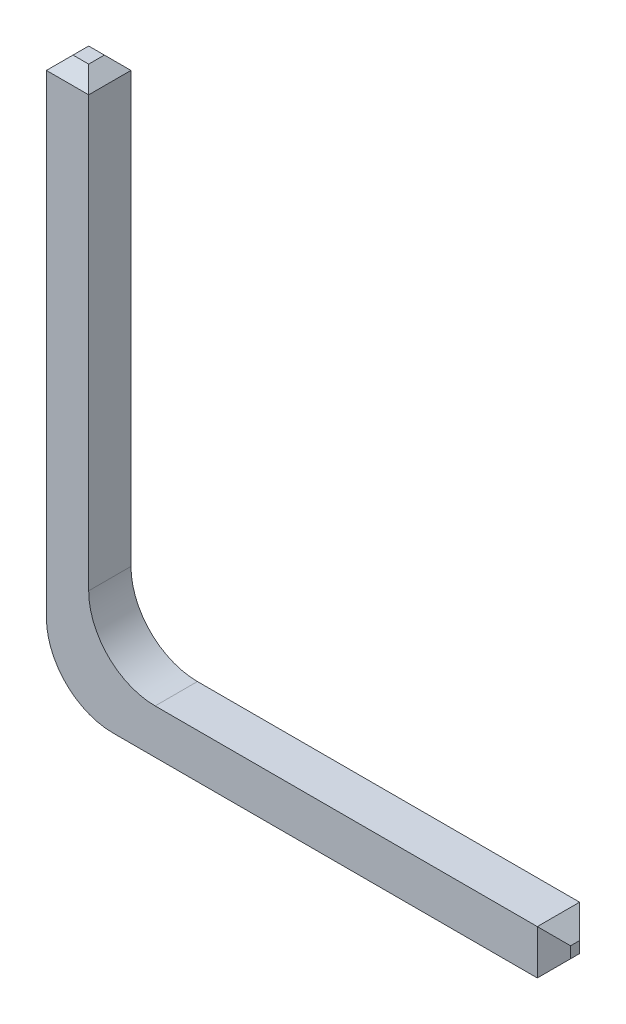
ISO-10303-21;
HEADER;
FILE_DESCRIPTION(('STEP AP214'),'2;1');
FILE_NAME('part.step','',(''),(''),'','','');
FILE_SCHEMA(('AUTOMOTIVE_DESIGN { 1 0 10303 214 1 1 1 1 }'));
ENDSEC;
DATA;
#1=APPLICATION_CONTEXT('core data for automotive mechanical design processes');
#2=APPLICATION_PROTOCOL_DEFINITION('international standard','automotive_design',2000,#1);
#3=PRODUCT_CONTEXT('',#1,'mechanical');
#4=PRODUCT('Part','Part','',(#3));
#5=PRODUCT_RELATED_PRODUCT_CATEGORY('part','',(#4));
#6=PRODUCT_DEFINITION_FORMATION('','',#4);
#7=PRODUCT_DEFINITION_CONTEXT('part definition',#1,'design');
#8=PRODUCT_DEFINITION('design','',#6,#7);
#9=PRODUCT_DEFINITION_SHAPE('','',#8);
#10=(LENGTH_UNIT() NAMED_UNIT(*) SI_UNIT(.MILLI.,.METRE.));
#11=(NAMED_UNIT(*) PLANE_ANGLE_UNIT() SI_UNIT($,.RADIAN.));
#12=(NAMED_UNIT(*) SI_UNIT($,.STERADIAN.) SOLID_ANGLE_UNIT());
#13=UNCERTAINTY_MEASURE_WITH_UNIT(LENGTH_MEASURE(1.E-05),#10,'distance_accuracy_value','');
#14=(GEOMETRIC_REPRESENTATION_CONTEXT(3) GLOBAL_UNCERTAINTY_ASSIGNED_CONTEXT((#13)) GLOBAL_UNIT_ASSIGNED_CONTEXT((#10,
#11,#12)) REPRESENTATION_CONTEXT('',''));
#15=CARTESIAN_POINT('',(0.,0.,0.));
#16=DIRECTION('',(0.,0.,1.));
#17=DIRECTION('',(1.,0.,0.));
#18=AXIS2_PLACEMENT_3D('',#15,#16,#17);
#19=CARTESIAN_POINT('',(0.,11.54,0.));
#20=DIRECTION('',(1.,0.,0.));
#21=DIRECTION('',(0.,0.,-1.));
#22=AXIS2_PLACEMENT_3D('',#19,#20,#21);
#23=PLANE('',#22);
#24=DIRECTION('',(0.,-1.,0.));
#25=VECTOR('',#24,1.);
#26=CARTESIAN_POINT('',(0.,11.54,0.));
#27=LINE('',#26,#25);
#28=CARTESIAN_POINT('',(0.,11.34,0.));
#29=VERTEX_POINT('',#28);
#30=CARTESIAN_POINT('',(0.,4.20708962701083,0.));
#31=VERTEX_POINT('',#30);
#32=EDGE_CURVE('E143',#29,#31,#27,.T.);
#33=ORIENTED_EDGE('',*,*,#32,.T.);
#34=DIRECTION('',(0.,0.,-1.));
#35=VECTOR('',#34,1.);
#36=CARTESIAN_POINT('',(0.,4.20708962701083,0.636));
#37=LINE('',#36,#35);
#38=CARTESIAN_POINT('',(0.,4.20708962701083,0.636));
#39=VERTEX_POINT('',#38);
#40=EDGE_CURVE('E49',#31,#39,#37,.F.);
#41=ORIENTED_EDGE('',*,*,#40,.T.);
#42=DIRECTION('',(0.,-1.,0.));
#43=VECTOR('',#42,1.);
#44=CARTESIAN_POINT('',(0.,11.54,0.636));
#45=LINE('',#44,#43);
#46=CARTESIAN_POINT('',(0.,11.34,0.636));
#47=VERTEX_POINT('',#46);
#48=EDGE_CURVE('E149',#47,#39,#45,.T.);
#49=ORIENTED_EDGE('',*,*,#48,.F.);
#50=DIRECTION('',(0.,0.,-1.));
#51=VECTOR('',#50,1.);
#52=CARTESIAN_POINT('',(0.,11.34,0.));
#53=LINE('',#52,#51);
#54=EDGE_CURVE('E164',#47,#29,#53,.T.);
#55=ORIENTED_EDGE('',*,*,#54,.T.);
#56=EDGE_LOOP('',(#33,#41,#49,#55));
#57=FACE_BOUND('',#56,.T.);
#58=ADVANCED_FACE('F34',(#57),#23,.F.);
#59=CARTESIAN_POINT('',(0.,11.54,0.636));
#60=DIRECTION('',(0.,0.,-1.));
#61=DIRECTION('',(-1.,0.,0.));
#62=AXIS2_PLACEMENT_3D('',#59,#60,#61);
#63=PLANE('',#62);
#64=ORIENTED_EDGE('',*,*,#48,.T.);
#65=CARTESIAN_POINT('',(1.,4.20708962701083,0.636));
#66=DIRECTION('',(0.,0.,-1.));
#67=DIRECTION('',(-1.,0.,0.));
#68=AXIS2_PLACEMENT_3D('',#65,#66,#67);
#69=CIRCLE('',#68,1.);
#70=CARTESIAN_POINT('',(1.,3.20708962701083,0.636));
#71=VERTEX_POINT('',#70);
#72=EDGE_CURVE('E184',#39,#71,#69,.F.);
#73=ORIENTED_EDGE('',*,*,#72,.T.);
#74=DIRECTION('',(1.,0.,0.));
#75=VECTOR('',#74,1.);
#76=CARTESIAN_POINT('',(0.636,3.20708962701083,0.636));
#77=LINE('',#76,#75);
#78=CARTESIAN_POINT('',(7.386,3.20708962701083,0.636));
#79=VERTEX_POINT('',#78);
#80=EDGE_CURVE('E217',#71,#79,#77,.T.);
#81=ORIENTED_EDGE('',*,*,#80,.T.);
#82=DIRECTION('',(0.,1.,0.));
#83=VECTOR('',#82,1.);
#84=CARTESIAN_POINT('',(7.386,3.87708962701083,0.636));
#85=LINE('',#84,#83);
#86=CARTESIAN_POINT('',(7.386,3.87708962701083,0.636));
#87=VERTEX_POINT('',#86);
#88=EDGE_CURVE('E236',#79,#87,#85,.T.);
#89=ORIENTED_EDGE('',*,*,#88,.T.);
#90=DIRECTION('',(-1.,0.,0.));
#91=VECTOR('',#90,1.);
#92=CARTESIAN_POINT('',(7.636,3.87708962701083,0.636));
#93=LINE('',#92,#91);
#94=CARTESIAN_POINT('',(1.636,3.87708962701083,0.636));
#95=VERTEX_POINT('',#94);
#96=EDGE_CURVE('E169',#87,#95,#93,.T.);
#97=ORIENTED_EDGE('',*,*,#96,.T.);
#98=CARTESIAN_POINT('',(1.636,4.87708962701083,0.636));
#99=DIRECTION('',(0.,0.,-1.));
#100=DIRECTION('',(-1.,0.,0.));
#101=AXIS2_PLACEMENT_3D('',#98,#99,#100);
#102=CIRCLE('',#101,1.);
#103=CARTESIAN_POINT('',(0.636,4.87708962701083,0.636));
#104=VERTEX_POINT('',#103);
#105=EDGE_CURVE('E11',#95,#104,#102,.T.);
#106=ORIENTED_EDGE('',*,*,#105,.T.);
#107=DIRECTION('',(0.,-1.,0.));
#108=VECTOR('',#107,1.);
#109=CARTESIAN_POINT('',(0.636,11.54,0.636));
#110=LINE('',#109,#108);
#111=CARTESIAN_POINT('',(0.636,11.34,0.636));
#112=VERTEX_POINT('',#111);
#113=EDGE_CURVE('E151',#112,#104,#110,.T.);
#114=ORIENTED_EDGE('',*,*,#113,.F.);
#115=DIRECTION('',(-1.,0.,0.));
#116=VECTOR('',#115,1.);
#117=CARTESIAN_POINT('',(0.,11.34,0.636));
#118=LINE('',#117,#116);
#119=EDGE_CURVE('E158',#112,#47,#118,.T.);
#120=ORIENTED_EDGE('',*,*,#119,.T.);
#121=EDGE_LOOP('',(#64,#73,#81,#89,#97,#106,#114,#120));
#122=FACE_BOUND('',#121,.T.);
#123=ADVANCED_FACE('F277',(#122),#63,.F.);
#124=CARTESIAN_POINT('',(0.636,11.54,0.));
#125=DIRECTION('',(-1.,0.,0.));
#126=DIRECTION('',(0.,0.,1.));
#127=AXIS2_PLACEMENT_3D('',#124,#125,#126);
#128=PLANE('',#127);
#129=ORIENTED_EDGE('',*,*,#113,.T.);
#130=DIRECTION('',(0.,0.,-1.));
#131=VECTOR('',#130,1.);
#132=CARTESIAN_POINT('',(0.636,4.87708962701083,0.));
#133=LINE('',#132,#131);
#134=CARTESIAN_POINT('',(0.636,4.87708962701083,0.));
#135=VERTEX_POINT('',#134);
#136=EDGE_CURVE('E211',#104,#135,#133,.T.);
#137=ORIENTED_EDGE('',*,*,#136,.T.);
#138=DIRECTION('',(0.,-1.,0.));
#139=VECTOR('',#138,1.);
#140=CARTESIAN_POINT('',(0.636,11.54,0.));
#141=LINE('',#140,#139);
#142=CARTESIAN_POINT('',(0.636,11.34,0.));
#143=VERTEX_POINT('',#142);
#144=EDGE_CURVE('E172',#143,#135,#141,.T.);
#145=ORIENTED_EDGE('',*,*,#144,.F.);
#146=DIRECTION('',(0.,0.,1.));
#147=VECTOR('',#146,1.);
#148=CARTESIAN_POINT('',(0.636,11.34,0.636));
#149=LINE('',#148,#147);
#150=EDGE_CURVE('E161',#143,#112,#149,.T.);
#151=ORIENTED_EDGE('',*,*,#150,.T.);
#152=EDGE_LOOP('',(#129,#137,#145,#151));
#153=FACE_BOUND('',#152,.T.);
#154=ADVANCED_FACE('F288',(#153),#128,.F.);
#155=CARTESIAN_POINT('',(0.,11.54,0.));
#156=DIRECTION('',(0.,0.,1.));
#157=DIRECTION('',(1.,0.,0.));
#158=AXIS2_PLACEMENT_3D('',#155,#156,#157);
#159=PLANE('',#158);
#160=DIRECTION('',(-1.,0.,0.));
#161=VECTOR('',#160,1.);
#162=CARTESIAN_POINT('',(0.636,3.20708962701083,0.));
#163=LINE('',#162,#161);
#164=CARTESIAN_POINT('',(7.386,3.20708962701083,0.));
#165=VERTEX_POINT('',#164);
#166=CARTESIAN_POINT('',(1.,3.20708962701083,0.));
#167=VERTEX_POINT('',#166);
#168=EDGE_CURVE('E206',#165,#167,#163,.T.);
#169=ORIENTED_EDGE('',*,*,#168,.T.);
#170=CARTESIAN_POINT('',(1.,4.20708962701083,0.));
#171=DIRECTION('',(0.,0.,1.));
#172=DIRECTION('',(1.,0.,0.));
#173=AXIS2_PLACEMENT_3D('',#170,#171,#172);
#174=CIRCLE('',#173,1.);
#175=EDGE_CURVE('E57',#167,#31,#174,.F.);
#176=ORIENTED_EDGE('',*,*,#175,.T.);
#177=ORIENTED_EDGE('',*,*,#32,.F.);
#178=DIRECTION('',(1.,0.,0.));
#179=VECTOR('',#178,1.);
#180=CARTESIAN_POINT('',(0.636,11.34,0.));
#181=LINE('',#180,#179);
#182=EDGE_CURVE('E140',#29,#143,#181,.T.);
#183=ORIENTED_EDGE('',*,*,#182,.T.);
#184=ORIENTED_EDGE('',*,*,#144,.T.);
#185=CARTESIAN_POINT('',(1.636,4.87708962701083,0.));
#186=DIRECTION('',(0.,0.,1.));
#187=DIRECTION('',(1.,0.,0.));
#188=AXIS2_PLACEMENT_3D('',#185,#186,#187);
#189=CIRCLE('',#188,1.);
#190=CARTESIAN_POINT('',(1.636,3.87708962701083,0.));
#191=VERTEX_POINT('',#190);
#192=EDGE_CURVE('E42',#135,#191,#189,.T.);
#193=ORIENTED_EDGE('',*,*,#192,.T.);
#194=DIRECTION('',(1.,0.,0.));
#195=VECTOR('',#194,1.);
#196=CARTESIAN_POINT('',(7.636,3.87708962701083,0.));
#197=LINE('',#196,#195);
#198=CARTESIAN_POINT('',(7.386,3.87708962701083,0.));
#199=VERTEX_POINT('',#198);
#200=EDGE_CURVE('E192',#191,#199,#197,.T.);
#201=ORIENTED_EDGE('',*,*,#200,.T.);
#202=DIRECTION('',(0.,-1.,0.));
#203=VECTOR('',#202,1.);
#204=CARTESIAN_POINT('',(7.386,3.20708962701083,0.));
#205=LINE('',#204,#203);
#206=EDGE_CURVE('E213',#199,#165,#205,.T.);
#207=ORIENTED_EDGE('',*,*,#206,.T.);
#208=EDGE_LOOP('',(#169,#176,#177,#183,#184,#193,#201,#207));
#209=FACE_BOUND('',#208,.T.);
#210=ADVANCED_FACE('F191',(#209),#159,.F.);
#211=CARTESIAN_POINT('',(0.,11.54,0.));
#212=DIRECTION('',(0.,1.,0.));
#213=DIRECTION('',(0.,0.,1.));
#214=AXIS2_PLACEMENT_3D('',#211,#212,#213);
#215=PLANE('',#214);
#216=DIRECTION('',(0.,0.,1.));
#217=VECTOR('',#216,1.);
#218=CARTESIAN_POINT('',(0.199999999999999,11.54,0.636));
#219=LINE('',#218,#217);
#220=CARTESIAN_POINT('',(0.199999999999999,11.54,0.199999999999999));
#221=VERTEX_POINT('',#220);
#222=CARTESIAN_POINT('',(0.199999999999999,11.54,0.436000000000001));
#223=VERTEX_POINT('',#222);
#224=EDGE_CURVE('E128',#221,#223,#219,.T.);
#225=ORIENTED_EDGE('',*,*,#224,.T.);
#226=DIRECTION('',(1.,0.,0.));
#227=VECTOR('',#226,1.);
#228=CARTESIAN_POINT('',(0.636,11.54,0.436000000000001));
#229=LINE('',#228,#227);
#230=CARTESIAN_POINT('',(0.436000000000001,11.54,0.436000000000001));
#231=VERTEX_POINT('',#230);
#232=EDGE_CURVE('E156',#223,#231,#229,.T.);
#233=ORIENTED_EDGE('',*,*,#232,.T.);
#234=DIRECTION('',(0.,0.,-1.));
#235=VECTOR('',#234,1.);
#236=CARTESIAN_POINT('',(0.436000000000001,11.54,0.));
#237=LINE('',#236,#235);
#238=CARTESIAN_POINT('',(0.436000000000001,11.54,0.199999999999999));
#239=VERTEX_POINT('',#238);
#240=EDGE_CURVE('E131',#231,#239,#237,.T.);
#241=ORIENTED_EDGE('',*,*,#240,.T.);
#242=DIRECTION('',(-1.,0.,0.));
#243=VECTOR('',#242,1.);
#244=CARTESIAN_POINT('',(0.,11.54,0.199999999999999));
#245=LINE('',#244,#243);
#246=EDGE_CURVE('E123',#239,#221,#245,.T.);
#247=ORIENTED_EDGE('',*,*,#246,.T.);
#248=EDGE_LOOP('',(#225,#233,#241,#247));
#249=FACE_BOUND('',#248,.T.);
#250=ADVANCED_FACE('F125',(#249),#215,.T.);
#251=CARTESIAN_POINT('',(0.,11.54,0.199999999999999));
#252=DIRECTION('',(0.,0.707106781186548,-0.707106781186548));
#253=DIRECTION('',(1.,0.,0.));
#254=AXIS2_PLACEMENT_3D('',#251,#252,#253);
#255=PLANE('',#254);
#256=DIRECTION('',(0.577350269189626,-0.577350269189626,-0.577350269189626));
#257=VECTOR('',#256,1.);
#258=CARTESIAN_POINT('',(0.290666666666668,11.6853333333333,0.345333333333333));
#259=LINE('',#258,#257);
#260=EDGE_CURVE('E144',#143,#239,#259,.F.);
#261=ORIENTED_EDGE('',*,*,#260,.F.);
#262=ORIENTED_EDGE('',*,*,#182,.F.);
#263=DIRECTION('',(-0.577350269189626,-0.577350269189626,-0.577350269189626));
#264=VECTOR('',#263,1.);
#265=CARTESIAN_POINT('',(0.133333333333333,11.4733333333333,0.133333333333332));
#266=LINE('',#265,#264);
#267=EDGE_CURVE('E138',#221,#29,#266,.T.);
#268=ORIENTED_EDGE('',*,*,#267,.F.);
#269=ORIENTED_EDGE('',*,*,#246,.F.);
#270=EDGE_LOOP('',(#261,#262,#268,#269));
#271=FACE_BOUND('',#270,.T.);
#272=ADVANCED_FACE('F139',(#271),#255,.T.);
#273=CARTESIAN_POINT('',(0.199999999999999,11.54,0.));
#274=DIRECTION('',(-0.707106781186548,0.707106781186548,0.));
#275=DIRECTION('',(0.,0.,-1.));
#276=AXIS2_PLACEMENT_3D('',#273,#274,#275);
#277=PLANE('',#276);
#278=ORIENTED_EDGE('',*,*,#267,.T.);
#279=ORIENTED_EDGE('',*,*,#54,.F.);
#280=DIRECTION('',(0.577350269189626,0.577350269189626,-0.577350269189626));
#281=VECTOR('',#280,1.);
#282=CARTESIAN_POINT('',(0.345333333333333,11.6853333333333,0.290666666666668));
#283=LINE('',#282,#281);
#284=EDGE_CURVE('E147',#223,#47,#283,.F.);
#285=ORIENTED_EDGE('',*,*,#284,.F.);
#286=ORIENTED_EDGE('',*,*,#224,.F.);
#287=EDGE_LOOP('',(#278,#279,#285,#286));
#288=FACE_BOUND('',#287,.T.);
#289=ADVANCED_FACE('F146',(#288),#277,.T.);
#290=CARTESIAN_POINT('',(0.436000000000001,11.54,0.));
#291=DIRECTION('',(0.707106781186548,0.707106781186548,0.));
#292=DIRECTION('',(0.,0.,1.));
#293=AXIS2_PLACEMENT_3D('',#290,#291,#292);
#294=PLANE('',#293);
#295=ORIENTED_EDGE('',*,*,#260,.T.);
#296=ORIENTED_EDGE('',*,*,#240,.F.);
#297=DIRECTION('',(0.577350269189626,-0.577350269189626,0.577350269189626));
#298=VECTOR('',#297,1.);
#299=CARTESIAN_POINT('',(0.290666666666668,11.6853333333333,0.290666666666667));
#300=LINE('',#299,#298);
#301=EDGE_CURVE('E167',#112,#231,#300,.F.);
#302=ORIENTED_EDGE('',*,*,#301,.F.);
#303=ORIENTED_EDGE('',*,*,#150,.F.);
#304=EDGE_LOOP('',(#295,#296,#302,#303));
#305=FACE_BOUND('',#304,.T.);
#306=ADVANCED_FACE('F286',(#305),#294,.T.);
#307=CARTESIAN_POINT('',(0.,11.54,0.436000000000001));
#308=DIRECTION('',(0.,0.707106781186548,0.707106781186548));
#309=DIRECTION('',(-1.,0.,0.));
#310=AXIS2_PLACEMENT_3D('',#307,#308,#309);
#311=PLANE('',#310);
#312=ORIENTED_EDGE('',*,*,#284,.T.);
#313=ORIENTED_EDGE('',*,*,#119,.F.);
#314=ORIENTED_EDGE('',*,*,#301,.T.);
#315=ORIENTED_EDGE('',*,*,#232,.F.);
#316=EDGE_LOOP('',(#312,#313,#314,#315));
#317=FACE_BOUND('',#316,.T.);
#318=ADVANCED_FACE('F283',(#317),#311,.T.);
#319=CARTESIAN_POINT('',(0.636,3.20708962701083,7.66799118315716));
#320=DIRECTION('',(0.,-1.,0.));
#321=DIRECTION('',(1.,0.,0.));
#322=AXIS2_PLACEMENT_3D('',#319,#320,#321);
#323=PLANE('',#322);
#324=ORIENTED_EDGE('',*,*,#80,.F.);
#325=DIRECTION('',(0.,0.,-1.));
#326=VECTOR('',#325,1.);
#327=CARTESIAN_POINT('',(1.,3.20708962701083,0.));
#328=LINE('',#327,#326);
#329=EDGE_CURVE('E187',#71,#167,#328,.T.);
#330=ORIENTED_EDGE('',*,*,#329,.T.);
#331=ORIENTED_EDGE('',*,*,#168,.F.);
#332=DIRECTION('',(0.,0.,1.));
#333=VECTOR('',#332,1.);
#334=CARTESIAN_POINT('',(7.386,3.20708962701083,7.66799118315716));
#335=LINE('',#334,#333);
#336=EDGE_CURVE('E238',#165,#79,#335,.T.);
#337=ORIENTED_EDGE('',*,*,#336,.T.);
#338=EDGE_LOOP('',(#324,#330,#331,#337));
#339=FACE_BOUND('',#338,.T.);
#340=ADVANCED_FACE('F275',(#339),#323,.T.);
#341=CARTESIAN_POINT('',(7.636,3.20708962701083,7.66799118315716));
#342=DIRECTION('',(1.,0.,0.));
#343=DIRECTION('',(0.,0.,-1.));
#344=AXIS2_PLACEMENT_3D('',#341,#342,#343);
#345=PLANE('',#344);
#346=DIRECTION('',(0.,1.,0.));
#347=VECTOR('',#346,1.);
#348=CARTESIAN_POINT('',(7.636,3.87708962701083,0.250000000000002));
#349=LINE('',#348,#347);
#350=CARTESIAN_POINT('',(7.636,3.45708962701083,0.250000000000002));
#351=VERTEX_POINT('',#350);
#352=CARTESIAN_POINT('',(7.636,3.62708962701083,0.250000000000002));
#353=VERTEX_POINT('',#352);
#354=EDGE_CURVE('E227',#351,#353,#349,.T.);
#355=ORIENTED_EDGE('',*,*,#354,.T.);
#356=DIRECTION('',(0.,0.,1.));
#357=VECTOR('',#356,1.);
#358=CARTESIAN_POINT('',(7.636,3.62708962701083,7.66799118315716));
#359=LINE('',#358,#357);
#360=CARTESIAN_POINT('',(7.636,3.62708962701083,0.385999999999998));
#361=VERTEX_POINT('',#360);
#362=EDGE_CURVE('E233',#353,#361,#359,.T.);
#363=ORIENTED_EDGE('',*,*,#362,.T.);
#364=DIRECTION('',(0.,-1.,0.));
#365=VECTOR('',#364,1.);
#366=CARTESIAN_POINT('',(7.636,3.20708962701083,0.385999999999998));
#367=LINE('',#366,#365);
#368=CARTESIAN_POINT('',(7.636,3.45708962701083,0.385999999999998));
#369=VERTEX_POINT('',#368);
#370=EDGE_CURVE('E231',#361,#369,#367,.T.);
#371=ORIENTED_EDGE('',*,*,#370,.T.);
#372=DIRECTION('',(0.,0.,-1.));
#373=VECTOR('',#372,1.);
#374=CARTESIAN_POINT('',(7.636,3.45708962701083,7.66799118315716));
#375=LINE('',#374,#373);
#376=EDGE_CURVE('E229',#369,#351,#375,.T.);
#377=ORIENTED_EDGE('',*,*,#376,.T.);
#378=EDGE_LOOP('',(#355,#363,#371,#377));
#379=FACE_BOUND('',#378,.T.);
#380=ADVANCED_FACE('F264',(#379),#345,.T.);
#381=CARTESIAN_POINT('',(7.636,3.87708962701083,7.66799118315716));
#382=DIRECTION('',(0.,1.,0.));
#383=DIRECTION('',(0.,0.,1.));
#384=AXIS2_PLACEMENT_3D('',#381,#382,#383);
#385=PLANE('',#384);
#386=ORIENTED_EDGE('',*,*,#200,.F.);
#387=DIRECTION('',(0.,0.,-1.));
#388=VECTOR('',#387,1.);
#389=CARTESIAN_POINT('',(1.636,3.87708962701083,7.66799118315716));
#390=LINE('',#389,#388);
#391=EDGE_CURVE('E203',#191,#95,#390,.F.);
#392=ORIENTED_EDGE('',*,*,#391,.T.);
#393=ORIENTED_EDGE('',*,*,#96,.F.);
#394=DIRECTION('',(0.,0.,-1.));
#395=VECTOR('',#394,1.);
#396=CARTESIAN_POINT('',(7.386,3.87708962701083,7.66799118315716));
#397=LINE('',#396,#395);
#398=EDGE_CURVE('E166',#87,#199,#397,.T.);
#399=ORIENTED_EDGE('',*,*,#398,.T.);
#400=EDGE_LOOP('',(#386,#392,#393,#399));
#401=FACE_BOUND('',#400,.T.);
#402=ADVANCED_FACE('F201',(#401),#385,.T.);
#403=CARTESIAN_POINT('',(7.636,3.45708962701083,7.66799118315716));
#404=DIRECTION('',(-0.707106781186547,0.707106781186547,0.));
#405=DIRECTION('',(0.,0.,-1.));
#406=AXIS2_PLACEMENT_3D('',#403,#404,#405);
#407=PLANE('',#406);
#408=DIRECTION('',(0.577350269189626,0.577350269189626,0.577350269189626));
#409=VECTOR('',#408,1.);
#410=CARTESIAN_POINT('',(10.1636367909964,5.98472641800722,2.77763679099639));
#411=LINE('',#410,#409);
#412=EDGE_CURVE('E247',#351,#165,#411,.F.);
#413=ORIENTED_EDGE('',*,*,#412,.F.);
#414=ORIENTED_EDGE('',*,*,#376,.F.);
#415=DIRECTION('',(0.577350269189626,0.577350269189626,-0.577350269189625));
#416=VECTOR('',#415,1.);
#417=CARTESIAN_POINT('',(5.20866960561428,1.02975923262511,2.81333039438572));
#418=LINE('',#417,#416);
#419=EDGE_CURVE('E207',#79,#369,#418,.T.);
#420=ORIENTED_EDGE('',*,*,#419,.F.);
#421=ORIENTED_EDGE('',*,*,#336,.F.);
#422=EDGE_LOOP('',(#413,#414,#420,#421));
#423=FACE_BOUND('',#422,.T.);
#424=ADVANCED_FACE('F261',(#423),#407,.F.);
#425=CARTESIAN_POINT('',(7.386,11.54,0.636));
#426=DIRECTION('',(0.707106781186547,0.,0.707106781186548));
#427=DIRECTION('',(0.,-1.,0.));
#428=AXIS2_PLACEMENT_3D('',#425,#426,#427);
#429=PLANE('',#428);
#430=ORIENTED_EDGE('',*,*,#419,.T.);
#431=ORIENTED_EDGE('',*,*,#370,.F.);
#432=DIRECTION('',(0.577350269189626,-0.577350269189626,-0.577350269189625));
#433=VECTOR('',#432,1.);
#434=CARTESIAN_POINT('',(4.83169654233694,6.43139308467389,3.19030345766306));
#435=LINE('',#434,#433);
#436=EDGE_CURVE('E245',#87,#361,#435,.T.);
#437=ORIENTED_EDGE('',*,*,#436,.F.);
#438=ORIENTED_EDGE('',*,*,#88,.F.);
#439=EDGE_LOOP('',(#430,#431,#437,#438));
#440=FACE_BOUND('',#439,.T.);
#441=ADVANCED_FACE('F255',(#440),#429,.T.);
#442=CARTESIAN_POINT('',(7.386,11.54,0.));
#443=DIRECTION('',(0.707106781186547,0.,-0.707106781186547));
#444=DIRECTION('',(0.,1.,0.));
#445=AXIS2_PLACEMENT_3D('',#442,#443,#444);
#446=PLANE('',#445);
#447=ORIENTED_EDGE('',*,*,#412,.T.);
#448=ORIENTED_EDGE('',*,*,#206,.F.);
#449=DIRECTION('',(-0.577350269189626,0.577350269189626,-0.577350269189626));
#450=VECTOR('',#449,1.);
#451=CARTESIAN_POINT('',(4.83169654233694,6.43139308467389,-2.55430345766306));
#452=LINE('',#451,#450);
#453=EDGE_CURVE('E243',#353,#199,#452,.T.);
#454=ORIENTED_EDGE('',*,*,#453,.F.);
#455=ORIENTED_EDGE('',*,*,#354,.F.);
#456=EDGE_LOOP('',(#447,#448,#454,#455));
#457=FACE_BOUND('',#456,.T.);
#458=ADVANCED_FACE('F271',(#457),#446,.T.);
#459=CARTESIAN_POINT('',(7.386,3.87708962701083,7.66799118315716));
#460=DIRECTION('',(-0.707106781186547,-0.707106781186547,0.));
#461=DIRECTION('',(0.,0.,-1.));
#462=AXIS2_PLACEMENT_3D('',#459,#460,#461);
#463=PLANE('',#462);
#464=ORIENTED_EDGE('',*,*,#436,.T.);
#465=ORIENTED_EDGE('',*,*,#362,.F.);
#466=ORIENTED_EDGE('',*,*,#453,.T.);
#467=ORIENTED_EDGE('',*,*,#398,.F.);
#468=EDGE_LOOP('',(#464,#465,#466,#467));
#469=FACE_BOUND('',#468,.T.);
#470=ADVANCED_FACE('F268',(#469),#463,.F.);
#471=CARTESIAN_POINT('',(1.636,4.87708962701083,0.));
#472=DIRECTION('',(0.,0.,-1.));
#473=DIRECTION('',(-1.,0.,0.));
#474=AXIS2_PLACEMENT_3D('',#471,#472,#473);
#475=CYLINDRICAL_SURFACE('',#474,1.);
#476=ORIENTED_EDGE('',*,*,#105,.F.);
#477=ORIENTED_EDGE('',*,*,#391,.F.);
#478=ORIENTED_EDGE('',*,*,#192,.F.);
#479=ORIENTED_EDGE('',*,*,#136,.F.);
#480=EDGE_LOOP('',(#476,#477,#478,#479));
#481=FACE_BOUND('',#480,.T.);
#482=ADVANCED_FACE('F210',(#481),#475,.F.);
#483=CARTESIAN_POINT('',(1.,4.20708962701083,7.66799118315716));
#484=DIRECTION('',(0.,0.,1.));
#485=DIRECTION('',(1.,0.,0.));
#486=AXIS2_PLACEMENT_3D('',#483,#484,#485);
#487=CYLINDRICAL_SURFACE('',#486,1.);
#488=ORIENTED_EDGE('',*,*,#72,.F.);
#489=ORIENTED_EDGE('',*,*,#40,.F.);
#490=ORIENTED_EDGE('',*,*,#175,.F.);
#491=ORIENTED_EDGE('',*,*,#329,.F.);
#492=EDGE_LOOP('',(#488,#489,#490,#491));
#493=FACE_BOUND('',#492,.T.);
#494=ADVANCED_FACE('F36',(#493),#487,.T.);
#495=CLOSED_SHELL('',(#58,#123,#154,#210,#250,#272,#289,#306,#318,#340,#380,#402,#424,#441,#458,
#470,#482,#494));
#496=MANIFOLD_SOLID_BREP('B2',#495);
#497=ADVANCED_BREP_SHAPE_REPRESENTATION('',(#18,#496),#14);
#498=SHAPE_DEFINITION_REPRESENTATION(#9,#497);
ENDSEC;
END-ISO-10303-21;
